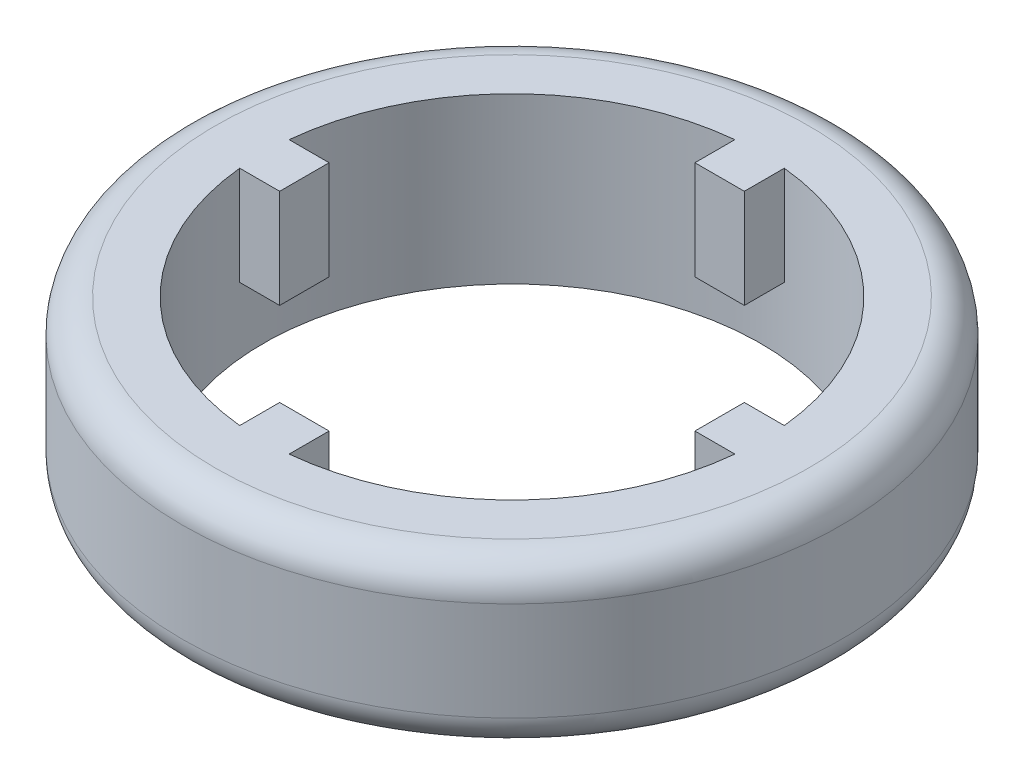
ISO-10303-21;
HEADER;
FILE_DESCRIPTION(('STEP AP214'),'2;1');
FILE_NAME('part.step','',(''),(''),'','','');
FILE_SCHEMA(('AUTOMOTIVE_DESIGN { 1 0 10303 214 1 1 1 1 }'));
ENDSEC;
DATA;
#1=APPLICATION_CONTEXT('core data for automotive mechanical design processes');
#2=APPLICATION_PROTOCOL_DEFINITION('international standard','automotive_design',2000,#1);
#3=PRODUCT_CONTEXT('',#1,'mechanical');
#4=PRODUCT('Part','Part','',(#3));
#5=PRODUCT_RELATED_PRODUCT_CATEGORY('part','',(#4));
#6=PRODUCT_DEFINITION_FORMATION('','',#4);
#7=PRODUCT_DEFINITION_CONTEXT('part definition',#1,'design');
#8=PRODUCT_DEFINITION('design','',#6,#7);
#9=PRODUCT_DEFINITION_SHAPE('','',#8);
#10=(LENGTH_UNIT() NAMED_UNIT(*) SI_UNIT(.MILLI.,.METRE.));
#11=(NAMED_UNIT(*) PLANE_ANGLE_UNIT() SI_UNIT($,.RADIAN.));
#12=(NAMED_UNIT(*) SI_UNIT($,.STERADIAN.) SOLID_ANGLE_UNIT());
#13=UNCERTAINTY_MEASURE_WITH_UNIT(LENGTH_MEASURE(1.E-05),#10,'distance_accuracy_value','');
#14=(GEOMETRIC_REPRESENTATION_CONTEXT(3) GLOBAL_UNCERTAINTY_ASSIGNED_CONTEXT((#13)) GLOBAL_UNIT_ASSIGNED_CONTEXT((#10,
#11,#12)) REPRESENTATION_CONTEXT('',''));
#15=CARTESIAN_POINT('',(0.,0.,0.));
#16=DIRECTION('',(0.,0.,1.));
#17=DIRECTION('',(1.,0.,0.));
#18=AXIS2_PLACEMENT_3D('',#15,#16,#17);
#19=CARTESIAN_POINT('',(0.,10.,0.));
#20=DIRECTION('',(0.,1.,0.));
#21=DIRECTION('',(0.,0.,1.));
#22=AXIS2_PLACEMENT_3D('',#19,#20,#21);
#23=PLANE('',#22);
#24=DIRECTION('',(0.,0.,1.));
#25=VECTOR('',#24,1.);
#26=CARTESIAN_POINT('',(-1.5,10.,12.6));
#27=LINE('',#26,#25);
#28=CARTESIAN_POINT('',(-1.5,10.,12.6));
#29=VERTEX_POINT('',#28);
#30=CARTESIAN_POINT('',(-1.5,10.,15.0253119767944));
#31=VERTEX_POINT('',#30);
#32=EDGE_CURVE('E160',#29,#31,#27,.T.);
#33=ORIENTED_EDGE('',*,*,#32,.T.);
#34=CARTESIAN_POINT('',(0.,10.,0.));
#35=DIRECTION('',(0.,1.,0.));
#36=DIRECTION('',(0.,0.,1.));
#37=AXIS2_PLACEMENT_3D('',#34,#35,#36);
#38=CIRCLE('',#37,15.1);
#39=CARTESIAN_POINT('',(-15.0253119767944,10.,1.5));
#40=VERTEX_POINT('',#39);
#41=EDGE_CURVE('E277',#40,#31,#38,.T.);
#42=ORIENTED_EDGE('',*,*,#41,.F.);
#43=DIRECTION('',(1.,0.,0.));
#44=VECTOR('',#43,1.);
#45=CARTESIAN_POINT('',(-12.6,10.,1.5));
#46=LINE('',#45,#44);
#47=CARTESIAN_POINT('',(-12.6,10.,1.5));
#48=VERTEX_POINT('',#47);
#49=EDGE_CURVE('E244',#40,#48,#46,.T.);
#50=ORIENTED_EDGE('',*,*,#49,.T.);
#51=DIRECTION('',(0.,0.,-1.));
#52=VECTOR('',#51,1.);
#53=CARTESIAN_POINT('',(-12.6,10.,-1.5));
#54=LINE('',#53,#52);
#55=CARTESIAN_POINT('',(-12.6,10.,-1.5));
#56=VERTEX_POINT('',#55);
#57=EDGE_CURVE('E263',#48,#56,#54,.T.);
#58=ORIENTED_EDGE('',*,*,#57,.T.);
#59=DIRECTION('',(-1.,0.,0.));
#60=VECTOR('',#59,1.);
#61=CARTESIAN_POINT('',(-12.6,10.,-1.5));
#62=LINE('',#61,#60);
#63=CARTESIAN_POINT('',(-15.0253119767944,10.,-1.5));
#64=VERTEX_POINT('',#63);
#65=EDGE_CURVE('E252',#56,#64,#62,.T.);
#66=ORIENTED_EDGE('',*,*,#65,.T.);
#67=CARTESIAN_POINT('',(-1.5,10.,-15.0253119767944));
#68=VERTEX_POINT('',#67);
#69=EDGE_CURVE('E282',#68,#64,#38,.T.);
#70=ORIENTED_EDGE('',*,*,#69,.F.);
#71=DIRECTION('',(0.,0.,1.));
#72=VECTOR('',#71,1.);
#73=CARTESIAN_POINT('',(-1.5,10.,-12.6));
#74=LINE('',#73,#72);
#75=CARTESIAN_POINT('',(-1.5,10.,-12.6));
#76=VERTEX_POINT('',#75);
#77=EDGE_CURVE('E215',#68,#76,#74,.T.);
#78=ORIENTED_EDGE('',*,*,#77,.T.);
#79=DIRECTION('',(1.,0.,0.));
#80=VECTOR('',#79,1.);
#81=CARTESIAN_POINT('',(1.5,10.,-12.6));
#82=LINE('',#81,#80);
#83=CARTESIAN_POINT('',(1.5,10.,-12.6));
#84=VERTEX_POINT('',#83);
#85=EDGE_CURVE('E234',#76,#84,#82,.T.);
#86=ORIENTED_EDGE('',*,*,#85,.T.);
#87=DIRECTION('',(0.,0.,-1.));
#88=VECTOR('',#87,1.);
#89=CARTESIAN_POINT('',(1.5,10.,-12.6));
#90=LINE('',#89,#88);
#91=CARTESIAN_POINT('',(1.5,10.,-15.0253119767944));
#92=VERTEX_POINT('',#91);
#93=EDGE_CURVE('E223',#84,#92,#90,.T.);
#94=ORIENTED_EDGE('',*,*,#93,.T.);
#95=CARTESIAN_POINT('',(15.0253119767944,10.,-1.5));
#96=VERTEX_POINT('',#95);
#97=EDGE_CURVE('E341',#96,#92,#38,.T.);
#98=ORIENTED_EDGE('',*,*,#97,.F.);
#99=DIRECTION('',(-1.,0.,0.));
#100=VECTOR('',#99,1.);
#101=CARTESIAN_POINT('',(12.6,10.,-1.5));
#102=LINE('',#101,#100);
#103=CARTESIAN_POINT('',(12.6,10.,-1.5));
#104=VERTEX_POINT('',#103);
#105=EDGE_CURVE('E188',#96,#104,#102,.T.);
#106=ORIENTED_EDGE('',*,*,#105,.T.);
#107=DIRECTION('',(0.,0.,1.));
#108=VECTOR('',#107,1.);
#109=CARTESIAN_POINT('',(12.6,10.,1.5));
#110=LINE('',#109,#108);
#111=CARTESIAN_POINT('',(12.6,10.,1.5));
#112=VERTEX_POINT('',#111);
#113=EDGE_CURVE('E205',#104,#112,#110,.T.);
#114=ORIENTED_EDGE('',*,*,#113,.T.);
#115=DIRECTION('',(1.,0.,0.));
#116=VECTOR('',#115,1.);
#117=CARTESIAN_POINT('',(12.6,10.,1.5));
#118=LINE('',#117,#116);
#119=CARTESIAN_POINT('',(15.0253119767944,10.,1.5));
#120=VERTEX_POINT('',#119);
#121=EDGE_CURVE('E194',#112,#120,#118,.T.);
#122=ORIENTED_EDGE('',*,*,#121,.T.);
#123=CARTESIAN_POINT('',(1.5,10.,15.0253119767944));
#124=VERTEX_POINT('',#123);
#125=EDGE_CURVE('E281',#124,#120,#38,.T.);
#126=ORIENTED_EDGE('',*,*,#125,.F.);
#127=DIRECTION('',(0.,0.,-1.));
#128=VECTOR('',#127,1.);
#129=CARTESIAN_POINT('',(1.5,10.,12.6));
#130=LINE('',#129,#128);
#131=CARTESIAN_POINT('',(1.5,10.,12.6));
#132=VERTEX_POINT('',#131);
#133=EDGE_CURVE('E179',#124,#132,#130,.T.);
#134=ORIENTED_EDGE('',*,*,#133,.T.);
#135=DIRECTION('',(-1.,0.,0.));
#136=VECTOR('',#135,1.);
#137=CARTESIAN_POINT('',(-1.5,10.,12.6));
#138=LINE('',#137,#136);
#139=EDGE_CURVE('E167',#132,#29,#138,.T.);
#140=ORIENTED_EDGE('',*,*,#139,.T.);
#141=EDGE_LOOP('',(#33,#42,#50,#58,#66,#70,#78,#86,#94,#98,#106,#114,#122,#126,#134,#140));
#142=FACE_BOUND('',#141,.T.);
#143=CARTESIAN_POINT('',(0.,10.,0.));
#144=DIRECTION('',(0.,1.,0.));
#145=DIRECTION('',(0.,0.,1.));
#146=AXIS2_PLACEMENT_3D('',#143,#144,#145);
#147=CIRCLE('',#146,18.);
#148=CARTESIAN_POINT('',(0.,10.,18.));
#149=VERTEX_POINT('',#148);
#150=EDGE_CURVE('E280',#149,#149,#147,.T.);
#151=ORIENTED_EDGE('',*,*,#150,.T.);
#152=EDGE_LOOP('',(#151));
#153=FACE_BOUND('',#152,.T.);
#154=ADVANCED_FACE('F39',(#142,#153),#23,.T.);
#155=CARTESIAN_POINT('',(0.,0.,0.));
#156=DIRECTION('',(0.,1.,0.));
#157=DIRECTION('',(0.,0.,1.));
#158=AXIS2_PLACEMENT_3D('',#155,#156,#157);
#159=PLANE('',#158);
#160=CARTESIAN_POINT('',(0.,0.,0.));
#161=DIRECTION('',(0.,1.,0.));
#162=DIRECTION('',(0.,0.,1.));
#163=AXIS2_PLACEMENT_3D('',#160,#161,#162);
#164=CIRCLE('',#163,18.);
#165=CARTESIAN_POINT('',(0.,0.,18.));
#166=VERTEX_POINT('',#165);
#167=EDGE_CURVE('E297',#166,#166,#164,.F.);
#168=ORIENTED_EDGE('',*,*,#167,.T.);
#169=EDGE_LOOP('',(#168));
#170=FACE_BOUND('',#169,.T.);
#171=CARTESIAN_POINT('',(0.,0.,0.));
#172=DIRECTION('',(0.,1.,0.));
#173=DIRECTION('',(0.,0.,1.));
#174=AXIS2_PLACEMENT_3D('',#171,#172,#173);
#175=CIRCLE('',#174,15.1);
#176=CARTESIAN_POINT('',(0.,0.,15.1));
#177=VERTEX_POINT('',#176);
#178=EDGE_CURVE('E273',#177,#177,#175,.T.);
#179=ORIENTED_EDGE('',*,*,#178,.T.);
#180=EDGE_LOOP('',(#179));
#181=FACE_BOUND('',#180,.T.);
#182=ADVANCED_FACE('F378',(#170,#181),#159,.F.);
#183=CARTESIAN_POINT('',(0.,10.,0.));
#184=DIRECTION('',(0.,-1.,0.));
#185=DIRECTION('',(0.,0.,-1.));
#186=AXIS2_PLACEMENT_3D('',#183,#184,#185);
#187=CYLINDRICAL_SURFACE('',#186,20.);
#188=CARTESIAN_POINT('',(0.,8.,0.));
#189=DIRECTION('',(0.,1.,0.));
#190=DIRECTION('',(0.,0.,1.));
#191=AXIS2_PLACEMENT_3D('',#188,#189,#190);
#192=CIRCLE('',#191,20.);
#193=CARTESIAN_POINT('',(0.,8.,20.));
#194=VERTEX_POINT('',#193);
#195=EDGE_CURVE('E293',#194,#194,#192,.F.);
#196=ORIENTED_EDGE('',*,*,#195,.T.);
#197=EDGE_LOOP('',(#196));
#198=FACE_BOUND('',#197,.T.);
#199=CARTESIAN_POINT('',(0.,2.,0.));
#200=DIRECTION('',(0.,1.,0.));
#201=DIRECTION('',(0.,0.,1.));
#202=AXIS2_PLACEMENT_3D('',#199,#200,#201);
#203=CIRCLE('',#202,20.);
#204=CARTESIAN_POINT('',(0.,2.,20.));
#205=VERTEX_POINT('',#204);
#206=EDGE_CURVE('E289',#205,#205,#203,.T.);
#207=ORIENTED_EDGE('',*,*,#206,.T.);
#208=EDGE_LOOP('',(#207));
#209=FACE_BOUND('',#208,.T.);
#210=ADVANCED_FACE('F383',(#198,#209),#187,.T.);
#211=CARTESIAN_POINT('',(0.,10.,0.));
#212=DIRECTION('',(0.,-1.,0.));
#213=DIRECTION('',(0.,0.,-1.));
#214=AXIS2_PLACEMENT_3D('',#211,#212,#213);
#215=CYLINDRICAL_SURFACE('',#214,15.1);
#216=DIRECTION('',(0.,-1.,0.));
#217=VECTOR('',#216,1.);
#218=CARTESIAN_POINT('',(-1.5,10.,15.0253119767944));
#219=LINE('',#218,#217);
#220=CARTESIAN_POINT('',(-1.5,4.,15.0253119767944));
#221=VERTEX_POINT('',#220);
#222=EDGE_CURVE('E11',#221,#31,#219,.F.);
#223=ORIENTED_EDGE('',*,*,#222,.F.);
#224=CARTESIAN_POINT('',(0.,4.,0.));
#225=DIRECTION('',(0.,-1.,0.));
#226=DIRECTION('',(0.,0.,-1.));
#227=AXIS2_PLACEMENT_3D('',#224,#225,#226);
#228=CIRCLE('',#227,15.1);
#229=CARTESIAN_POINT('',(1.5,4.,15.0253119767944));
#230=VERTEX_POINT('',#229);
#231=EDGE_CURVE('E57',#230,#221,#228,.T.);
#232=ORIENTED_EDGE('',*,*,#231,.F.);
#233=DIRECTION('',(0.,-1.,0.));
#234=VECTOR('',#233,1.);
#235=CARTESIAN_POINT('',(1.5,10.,15.0253119767944));
#236=LINE('',#235,#234);
#237=EDGE_CURVE('E48',#124,#230,#236,.T.);
#238=ORIENTED_EDGE('',*,*,#237,.F.);
#239=ORIENTED_EDGE('',*,*,#125,.T.);
#240=DIRECTION('',(0.,-1.,0.));
#241=VECTOR('',#240,1.);
#242=CARTESIAN_POINT('',(15.0253119767944,10.,1.5));
#243=LINE('',#242,#241);
#244=CARTESIAN_POINT('',(15.0253119767944,4.,1.5));
#245=VERTEX_POINT('',#244);
#246=EDGE_CURVE('E333',#245,#120,#243,.F.);
#247=ORIENTED_EDGE('',*,*,#246,.F.);
#248=CARTESIAN_POINT('',(0.,4.,0.));
#249=DIRECTION('',(0.,-1.,0.));
#250=DIRECTION('',(0.,0.,-1.));
#251=AXIS2_PLACEMENT_3D('',#248,#249,#250);
#252=CIRCLE('',#251,15.1);
#253=CARTESIAN_POINT('',(15.0253119767944,4.,-1.5));
#254=VERTEX_POINT('',#253);
#255=EDGE_CURVE('E325',#254,#245,#252,.T.);
#256=ORIENTED_EDGE('',*,*,#255,.F.);
#257=DIRECTION('',(0.,-1.,0.));
#258=VECTOR('',#257,1.);
#259=CARTESIAN_POINT('',(15.0253119767944,10.,-1.5));
#260=LINE('',#259,#258);
#261=EDGE_CURVE('E329',#96,#254,#260,.T.);
#262=ORIENTED_EDGE('',*,*,#261,.F.);
#263=ORIENTED_EDGE('',*,*,#97,.T.);
#264=DIRECTION('',(0.,-1.,0.));
#265=VECTOR('',#264,1.);
#266=CARTESIAN_POINT('',(1.5,10.,-15.0253119767944));
#267=LINE('',#266,#265);
#268=CARTESIAN_POINT('',(1.5,4.,-15.0253119767944));
#269=VERTEX_POINT('',#268);
#270=EDGE_CURVE('E321',#269,#92,#267,.F.);
#271=ORIENTED_EDGE('',*,*,#270,.F.);
#272=CARTESIAN_POINT('',(0.,4.,0.));
#273=DIRECTION('',(0.,-1.,0.));
#274=DIRECTION('',(0.,0.,-1.));
#275=AXIS2_PLACEMENT_3D('',#272,#273,#274);
#276=CIRCLE('',#275,15.1);
#277=CARTESIAN_POINT('',(-1.5,4.,-15.0253119767944));
#278=VERTEX_POINT('',#277);
#279=EDGE_CURVE('E313',#278,#269,#276,.T.);
#280=ORIENTED_EDGE('',*,*,#279,.F.);
#281=DIRECTION('',(0.,-1.,0.));
#282=VECTOR('',#281,1.);
#283=CARTESIAN_POINT('',(-1.5,10.,-15.0253119767944));
#284=LINE('',#283,#282);
#285=EDGE_CURVE('E317',#68,#278,#284,.T.);
#286=ORIENTED_EDGE('',*,*,#285,.F.);
#287=ORIENTED_EDGE('',*,*,#69,.T.);
#288=DIRECTION('',(0.,-1.,0.));
#289=VECTOR('',#288,1.);
#290=CARTESIAN_POINT('',(-15.0253119767944,10.,-1.5));
#291=LINE('',#290,#289);
#292=CARTESIAN_POINT('',(-15.0253119767944,4.,-1.5));
#293=VERTEX_POINT('',#292);
#294=EDGE_CURVE('E309',#293,#64,#291,.F.);
#295=ORIENTED_EDGE('',*,*,#294,.F.);
#296=CARTESIAN_POINT('',(0.,4.,0.));
#297=DIRECTION('',(0.,-1.,0.));
#298=DIRECTION('',(0.,0.,-1.));
#299=AXIS2_PLACEMENT_3D('',#296,#297,#298);
#300=CIRCLE('',#299,15.1);
#301=CARTESIAN_POINT('',(-15.0253119767944,4.,1.5));
#302=VERTEX_POINT('',#301);
#303=EDGE_CURVE('E301',#302,#293,#300,.T.);
#304=ORIENTED_EDGE('',*,*,#303,.F.);
#305=DIRECTION('',(0.,-1.,0.));
#306=VECTOR('',#305,1.);
#307=CARTESIAN_POINT('',(-15.0253119767944,10.,1.5));
#308=LINE('',#307,#306);
#309=EDGE_CURVE('E305',#40,#302,#308,.T.);
#310=ORIENTED_EDGE('',*,*,#309,.F.);
#311=ORIENTED_EDGE('',*,*,#41,.T.);
#312=EDGE_LOOP('',(#223,#232,#238,#239,#247,#256,#262,#263,#271,#280,#286,#287,#295,#304,#310,#311));
#313=FACE_BOUND('',#312,.T.);
#314=ORIENTED_EDGE('',*,*,#178,.F.);
#315=EDGE_LOOP('',(#314));
#316=FACE_BOUND('',#315,.T.);
#317=ADVANCED_FACE('F344',(#313,#316),#215,.F.);
#318=CARTESIAN_POINT('',(0.,8.,0.));
#319=DIRECTION('',(0.,1.,0.));
#320=DIRECTION('',(0.,0.,1.));
#321=AXIS2_PLACEMENT_3D('',#318,#319,#320);
#322=TOROIDAL_SURFACE('',#321,18.,2.);
#323=ORIENTED_EDGE('',*,*,#195,.F.);
#324=EDGE_LOOP('',(#323));
#325=FACE_BOUND('',#324,.T.);
#326=ORIENTED_EDGE('',*,*,#150,.F.);
#327=EDGE_LOOP('',(#326));
#328=FACE_BOUND('',#327,.T.);
#329=ADVANCED_FACE('F389',(#325,#328),#322,.T.);
#330=CARTESIAN_POINT('',(0.,2.,0.));
#331=DIRECTION('',(0.,1.,0.));
#332=DIRECTION('',(0.,0.,1.));
#333=AXIS2_PLACEMENT_3D('',#330,#331,#332);
#334=TOROIDAL_SURFACE('',#333,18.,2.);
#335=ORIENTED_EDGE('',*,*,#167,.F.);
#336=EDGE_LOOP('',(#335));
#337=FACE_BOUND('',#336,.T.);
#338=ORIENTED_EDGE('',*,*,#206,.F.);
#339=EDGE_LOOP('',(#338));
#340=FACE_BOUND('',#339,.T.);
#341=ADVANCED_FACE('F41',(#337,#340),#334,.T.);
#342=CARTESIAN_POINT('',(0.,4.,0.));
#343=DIRECTION('',(0.,-1.,0.));
#344=DIRECTION('',(0.,0.,-1.));
#345=AXIS2_PLACEMENT_3D('',#342,#343,#344);
#346=PLANE('',#345);
#347=DIRECTION('',(1.,0.,0.));
#348=VECTOR('',#347,1.);
#349=CARTESIAN_POINT('',(-12.6,4.,1.5));
#350=LINE('',#349,#348);
#351=CARTESIAN_POINT('',(-12.6,4.,1.5));
#352=VERTEX_POINT('',#351);
#353=EDGE_CURVE('E248',#302,#352,#350,.T.);
#354=ORIENTED_EDGE('',*,*,#353,.F.);
#355=ORIENTED_EDGE('',*,*,#303,.T.);
#356=DIRECTION('',(-1.,0.,0.));
#357=VECTOR('',#356,1.);
#358=CARTESIAN_POINT('',(-12.6,4.,-1.5));
#359=LINE('',#358,#357);
#360=CARTESIAN_POINT('',(-12.6,4.,-1.5));
#361=VERTEX_POINT('',#360);
#362=EDGE_CURVE('E256',#361,#293,#359,.T.);
#363=ORIENTED_EDGE('',*,*,#362,.F.);
#364=DIRECTION('',(0.,0.,-1.));
#365=VECTOR('',#364,1.);
#366=CARTESIAN_POINT('',(-12.6,4.,-1.5));
#367=LINE('',#366,#365);
#368=EDGE_CURVE('E251',#352,#361,#367,.T.);
#369=ORIENTED_EDGE('',*,*,#368,.F.);
#370=EDGE_LOOP('',(#354,#355,#363,#369));
#371=FACE_BOUND('',#370,.T.);
#372=ADVANCED_FACE('F361',(#371),#346,.T.);
#373=CARTESIAN_POINT('',(-12.6,4.,-1.5));
#374=DIRECTION('',(0.,0.,-1.));
#375=DIRECTION('',(-1.,0.,0.));
#376=AXIS2_PLACEMENT_3D('',#373,#374,#375);
#377=PLANE('',#376);
#378=ORIENTED_EDGE('',*,*,#362,.T.);
#379=ORIENTED_EDGE('',*,*,#294,.T.);
#380=ORIENTED_EDGE('',*,*,#65,.F.);
#381=DIRECTION('',(0.,1.,0.));
#382=VECTOR('',#381,1.);
#383=CARTESIAN_POINT('',(-12.6,4.,-1.5));
#384=LINE('',#383,#382);
#385=EDGE_CURVE('E270',#361,#56,#384,.T.);
#386=ORIENTED_EDGE('',*,*,#385,.F.);
#387=EDGE_LOOP('',(#378,#379,#380,#386));
#388=FACE_BOUND('',#387,.T.);
#389=ADVANCED_FACE('F350',(#388),#377,.T.);
#390=CARTESIAN_POINT('',(-12.6,4.,-1.5));
#391=DIRECTION('',(1.,0.,0.));
#392=DIRECTION('',(0.,0.,-1.));
#393=AXIS2_PLACEMENT_3D('',#390,#391,#392);
#394=PLANE('',#393);
#395=ORIENTED_EDGE('',*,*,#57,.F.);
#396=DIRECTION('',(0.,1.,0.));
#397=VECTOR('',#396,1.);
#398=CARTESIAN_POINT('',(-12.6,4.,1.5));
#399=LINE('',#398,#397);
#400=EDGE_CURVE('E260',#352,#48,#399,.T.);
#401=ORIENTED_EDGE('',*,*,#400,.F.);
#402=ORIENTED_EDGE('',*,*,#368,.T.);
#403=ORIENTED_EDGE('',*,*,#385,.T.);
#404=EDGE_LOOP('',(#395,#401,#402,#403));
#405=FACE_BOUND('',#404,.T.);
#406=ADVANCED_FACE('F357',(#405),#394,.T.);
#407=CARTESIAN_POINT('',(-12.6,4.,1.5));
#408=DIRECTION('',(0.,0.,1.));
#409=DIRECTION('',(1.,0.,0.));
#410=AXIS2_PLACEMENT_3D('',#407,#408,#409);
#411=PLANE('',#410);
#412=ORIENTED_EDGE('',*,*,#49,.F.);
#413=ORIENTED_EDGE('',*,*,#309,.T.);
#414=ORIENTED_EDGE('',*,*,#353,.T.);
#415=ORIENTED_EDGE('',*,*,#400,.T.);
#416=EDGE_LOOP('',(#412,#413,#414,#415));
#417=FACE_BOUND('',#416,.T.);
#418=ADVANCED_FACE('F364',(#417),#411,.T.);
#419=CARTESIAN_POINT('',(0.,4.,0.));
#420=DIRECTION('',(0.,-1.,0.));
#421=DIRECTION('',(0.,0.,-1.));
#422=AXIS2_PLACEMENT_3D('',#419,#420,#421);
#423=PLANE('',#422);
#424=DIRECTION('',(0.,0.,1.));
#425=VECTOR('',#424,1.);
#426=CARTESIAN_POINT('',(-1.5,4.,-12.6));
#427=LINE('',#426,#425);
#428=CARTESIAN_POINT('',(-1.5,4.,-12.6));
#429=VERTEX_POINT('',#428);
#430=EDGE_CURVE('E219',#278,#429,#427,.T.);
#431=ORIENTED_EDGE('',*,*,#430,.F.);
#432=ORIENTED_EDGE('',*,*,#279,.T.);
#433=DIRECTION('',(0.,0.,-1.));
#434=VECTOR('',#433,1.);
#435=CARTESIAN_POINT('',(1.5,4.,-12.6));
#436=LINE('',#435,#434);
#437=CARTESIAN_POINT('',(1.5,4.,-12.6));
#438=VERTEX_POINT('',#437);
#439=EDGE_CURVE('E227',#438,#269,#436,.T.);
#440=ORIENTED_EDGE('',*,*,#439,.F.);
#441=DIRECTION('',(1.,0.,0.));
#442=VECTOR('',#441,1.);
#443=CARTESIAN_POINT('',(1.5,4.,-12.6));
#444=LINE('',#443,#442);
#445=EDGE_CURVE('E222',#429,#438,#444,.T.);
#446=ORIENTED_EDGE('',*,*,#445,.F.);
#447=EDGE_LOOP('',(#431,#432,#440,#446));
#448=FACE_BOUND('',#447,.T.);
#449=ADVANCED_FACE('F366',(#448),#423,.T.);
#450=CARTESIAN_POINT('',(1.5,4.,-12.6));
#451=DIRECTION('',(1.,0.,0.));
#452=DIRECTION('',(0.,0.,-1.));
#453=AXIS2_PLACEMENT_3D('',#450,#451,#452);
#454=PLANE('',#453);
#455=ORIENTED_EDGE('',*,*,#439,.T.);
#456=ORIENTED_EDGE('',*,*,#270,.T.);
#457=ORIENTED_EDGE('',*,*,#93,.F.);
#458=DIRECTION('',(0.,1.,0.));
#459=VECTOR('',#458,1.);
#460=CARTESIAN_POINT('',(1.5,4.,-12.6));
#461=LINE('',#460,#459);
#462=EDGE_CURVE('E241',#438,#84,#461,.T.);
#463=ORIENTED_EDGE('',*,*,#462,.F.);
#464=EDGE_LOOP('',(#455,#456,#457,#463));
#465=FACE_BOUND('',#464,.T.);
#466=ADVANCED_FACE('F372',(#465),#454,.T.);
#467=CARTESIAN_POINT('',(1.5,4.,-12.6));
#468=DIRECTION('',(0.,0.,1.));
#469=DIRECTION('',(1.,0.,0.));
#470=AXIS2_PLACEMENT_3D('',#467,#468,#469);
#471=PLANE('',#470);
#472=ORIENTED_EDGE('',*,*,#85,.F.);
#473=DIRECTION('',(0.,1.,0.));
#474=VECTOR('',#473,1.);
#475=CARTESIAN_POINT('',(-1.5,4.,-12.6));
#476=LINE('',#475,#474);
#477=EDGE_CURVE('E231',#429,#76,#476,.T.);
#478=ORIENTED_EDGE('',*,*,#477,.F.);
#479=ORIENTED_EDGE('',*,*,#445,.T.);
#480=ORIENTED_EDGE('',*,*,#462,.T.);
#481=EDGE_LOOP('',(#472,#478,#479,#480));
#482=FACE_BOUND('',#481,.T.);
#483=ADVANCED_FACE('F480',(#482),#471,.T.);
#484=CARTESIAN_POINT('',(-1.5,4.,-12.6));
#485=DIRECTION('',(-1.,0.,0.));
#486=DIRECTION('',(0.,0.,1.));
#487=AXIS2_PLACEMENT_3D('',#484,#485,#486);
#488=PLANE('',#487);
#489=ORIENTED_EDGE('',*,*,#77,.F.);
#490=ORIENTED_EDGE('',*,*,#285,.T.);
#491=ORIENTED_EDGE('',*,*,#430,.T.);
#492=ORIENTED_EDGE('',*,*,#477,.T.);
#493=EDGE_LOOP('',(#489,#490,#491,#492));
#494=FACE_BOUND('',#493,.T.);
#495=ADVANCED_FACE('F489',(#494),#488,.T.);
#496=CARTESIAN_POINT('',(0.,4.,0.));
#497=DIRECTION('',(0.,-1.,0.));
#498=DIRECTION('',(0.,0.,-1.));
#499=AXIS2_PLACEMENT_3D('',#496,#497,#498);
#500=PLANE('',#499);
#501=DIRECTION('',(-1.,0.,0.));
#502=VECTOR('',#501,1.);
#503=CARTESIAN_POINT('',(12.6,4.,-1.5));
#504=LINE('',#503,#502);
#505=CARTESIAN_POINT('',(12.6,4.,-1.5));
#506=VERTEX_POINT('',#505);
#507=EDGE_CURVE('E190',#254,#506,#504,.T.);
#508=ORIENTED_EDGE('',*,*,#507,.F.);
#509=ORIENTED_EDGE('',*,*,#255,.T.);
#510=DIRECTION('',(1.,0.,0.));
#511=VECTOR('',#510,1.);
#512=CARTESIAN_POINT('',(12.6,4.,1.5));
#513=LINE('',#512,#511);
#514=CARTESIAN_POINT('',(12.6,4.,1.5));
#515=VERTEX_POINT('',#514);
#516=EDGE_CURVE('E198',#515,#245,#513,.T.);
#517=ORIENTED_EDGE('',*,*,#516,.F.);
#518=DIRECTION('',(0.,0.,1.));
#519=VECTOR('',#518,1.);
#520=CARTESIAN_POINT('',(12.6,4.,1.5));
#521=LINE('',#520,#519);
#522=EDGE_CURVE('E193',#506,#515,#521,.T.);
#523=ORIENTED_EDGE('',*,*,#522,.F.);
#524=EDGE_LOOP('',(#508,#509,#517,#523));
#525=FACE_BOUND('',#524,.T.);
#526=ADVANCED_FACE('F498',(#525),#500,.T.);
#527=CARTESIAN_POINT('',(12.6,4.,1.5));
#528=DIRECTION('',(0.,0.,1.));
#529=DIRECTION('',(1.,0.,0.));
#530=AXIS2_PLACEMENT_3D('',#527,#528,#529);
#531=PLANE('',#530);
#532=ORIENTED_EDGE('',*,*,#516,.T.);
#533=ORIENTED_EDGE('',*,*,#246,.T.);
#534=ORIENTED_EDGE('',*,*,#121,.F.);
#535=DIRECTION('',(0.,1.,0.));
#536=VECTOR('',#535,1.);
#537=CARTESIAN_POINT('',(12.6,4.,1.5));
#538=LINE('',#537,#536);
#539=EDGE_CURVE('E212',#515,#112,#538,.T.);
#540=ORIENTED_EDGE('',*,*,#539,.F.);
#541=EDGE_LOOP('',(#532,#533,#534,#540));
#542=FACE_BOUND('',#541,.T.);
#543=ADVANCED_FACE('F507',(#542),#531,.T.);
#544=CARTESIAN_POINT('',(12.6,4.,1.5));
#545=DIRECTION('',(-1.,0.,0.));
#546=DIRECTION('',(0.,0.,1.));
#547=AXIS2_PLACEMENT_3D('',#544,#545,#546);
#548=PLANE('',#547);
#549=ORIENTED_EDGE('',*,*,#113,.F.);
#550=DIRECTION('',(0.,1.,0.));
#551=VECTOR('',#550,1.);
#552=CARTESIAN_POINT('',(12.6,4.,-1.5));
#553=LINE('',#552,#551);
#554=EDGE_CURVE('E202',#506,#104,#553,.T.);
#555=ORIENTED_EDGE('',*,*,#554,.F.);
#556=ORIENTED_EDGE('',*,*,#522,.T.);
#557=ORIENTED_EDGE('',*,*,#539,.T.);
#558=EDGE_LOOP('',(#549,#555,#556,#557));
#559=FACE_BOUND('',#558,.T.);
#560=ADVANCED_FACE('F516',(#559),#548,.T.);
#561=CARTESIAN_POINT('',(12.6,4.,-1.5));
#562=DIRECTION('',(0.,0.,-1.));
#563=DIRECTION('',(-1.,0.,0.));
#564=AXIS2_PLACEMENT_3D('',#561,#562,#563);
#565=PLANE('',#564);
#566=ORIENTED_EDGE('',*,*,#105,.F.);
#567=ORIENTED_EDGE('',*,*,#261,.T.);
#568=ORIENTED_EDGE('',*,*,#507,.T.);
#569=ORIENTED_EDGE('',*,*,#554,.T.);
#570=EDGE_LOOP('',(#566,#567,#568,#569));
#571=FACE_BOUND('',#570,.T.);
#572=ADVANCED_FACE('F525',(#571),#565,.T.);
#573=CARTESIAN_POINT('',(0.,4.,0.));
#574=DIRECTION('',(0.,-1.,0.));
#575=DIRECTION('',(0.,0.,-1.));
#576=AXIS2_PLACEMENT_3D('',#573,#574,#575);
#577=PLANE('',#576);
#578=DIRECTION('',(0.,0.,-1.));
#579=VECTOR('',#578,1.);
#580=CARTESIAN_POINT('',(1.5,4.,12.6));
#581=LINE('',#580,#579);
#582=CARTESIAN_POINT('',(1.5,4.,12.6));
#583=VERTEX_POINT('',#582);
#584=EDGE_CURVE('E150',#230,#583,#581,.T.);
#585=ORIENTED_EDGE('',*,*,#584,.F.);
#586=ORIENTED_EDGE('',*,*,#231,.T.);
#587=DIRECTION('',(0.,0.,1.));
#588=VECTOR('',#587,1.);
#589=CARTESIAN_POINT('',(-1.5,4.,12.6));
#590=LINE('',#589,#588);
#591=CARTESIAN_POINT('',(-1.5,4.,12.6));
#592=VERTEX_POINT('',#591);
#593=EDGE_CURVE('E170',#592,#221,#590,.T.);
#594=ORIENTED_EDGE('',*,*,#593,.F.);
#595=DIRECTION('',(-1.,0.,0.));
#596=VECTOR('',#595,1.);
#597=CARTESIAN_POINT('',(-1.5,4.,12.6));
#598=LINE('',#597,#596);
#599=EDGE_CURVE('E159',#583,#592,#598,.T.);
#600=ORIENTED_EDGE('',*,*,#599,.F.);
#601=EDGE_LOOP('',(#585,#586,#594,#600));
#602=FACE_BOUND('',#601,.T.);
#603=ADVANCED_FACE('F172',(#602),#577,.T.);
#604=CARTESIAN_POINT('',(-1.5,4.,12.6));
#605=DIRECTION('',(-1.,0.,0.));
#606=DIRECTION('',(0.,0.,1.));
#607=AXIS2_PLACEMENT_3D('',#604,#605,#606);
#608=PLANE('',#607);
#609=ORIENTED_EDGE('',*,*,#593,.T.);
#610=ORIENTED_EDGE('',*,*,#222,.T.);
#611=ORIENTED_EDGE('',*,*,#32,.F.);
#612=DIRECTION('',(0.,1.,0.));
#613=VECTOR('',#612,1.);
#614=CARTESIAN_POINT('',(-1.5,4.,12.6));
#615=LINE('',#614,#613);
#616=EDGE_CURVE('E169',#592,#29,#615,.T.);
#617=ORIENTED_EDGE('',*,*,#616,.F.);
#618=EDGE_LOOP('',(#609,#610,#611,#617));
#619=FACE_BOUND('',#618,.T.);
#620=ADVANCED_FACE('F542',(#619),#608,.T.);
#621=CARTESIAN_POINT('',(-1.5,4.,12.6));
#622=DIRECTION('',(0.,0.,-1.));
#623=DIRECTION('',(-1.,0.,0.));
#624=AXIS2_PLACEMENT_3D('',#621,#622,#623);
#625=PLANE('',#624);
#626=ORIENTED_EDGE('',*,*,#139,.F.);
#627=DIRECTION('',(0.,1.,0.));
#628=VECTOR('',#627,1.);
#629=CARTESIAN_POINT('',(1.5,4.,12.6));
#630=LINE('',#629,#628);
#631=EDGE_CURVE('E154',#583,#132,#630,.T.);
#632=ORIENTED_EDGE('',*,*,#631,.F.);
#633=ORIENTED_EDGE('',*,*,#599,.T.);
#634=ORIENTED_EDGE('',*,*,#616,.T.);
#635=EDGE_LOOP('',(#626,#632,#633,#634));
#636=FACE_BOUND('',#635,.T.);
#637=ADVANCED_FACE('F164',(#636),#625,.T.);
#638=CARTESIAN_POINT('',(1.5,4.,12.6));
#639=DIRECTION('',(1.,0.,0.));
#640=DIRECTION('',(0.,0.,-1.));
#641=AXIS2_PLACEMENT_3D('',#638,#639,#640);
#642=PLANE('',#641);
#643=ORIENTED_EDGE('',*,*,#133,.F.);
#644=ORIENTED_EDGE('',*,*,#237,.T.);
#645=ORIENTED_EDGE('',*,*,#584,.T.);
#646=ORIENTED_EDGE('',*,*,#631,.T.);
#647=EDGE_LOOP('',(#643,#644,#645,#646));
#648=FACE_BOUND('',#647,.T.);
#649=ADVANCED_FACE('F153',(#648),#642,.T.);
#650=CLOSED_SHELL('',(#154,#182,#210,#317,#329,#341,#372,#389,#406,#418,#449,#466,#483,#495,
#526,#543,#560,#572,#603,#620,#637,#649));
#651=MANIFOLD_SOLID_BREP('B2',#650);
#652=ADVANCED_BREP_SHAPE_REPRESENTATION('',(#18,#651),#14);
#653=SHAPE_DEFINITION_REPRESENTATION(#9,#652);
ENDSEC;
END-ISO-10303-21;
